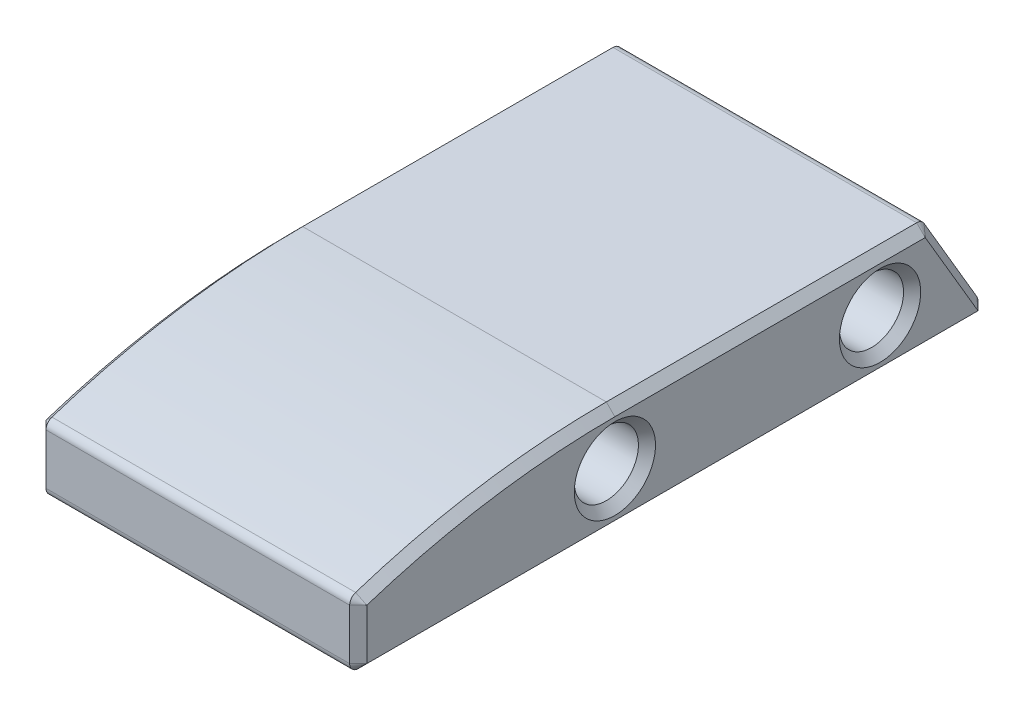
ISO-10303-21;
HEADER;
FILE_DESCRIPTION(('STEP AP214'),'2;1');
FILE_NAME('part.step','',(''),(''),'','','');
FILE_SCHEMA(('AUTOMOTIVE_DESIGN { 1 0 10303 214 1 1 1 1 }'));
ENDSEC;
DATA;
#1=APPLICATION_CONTEXT('core data for automotive mechanical design processes');
#2=APPLICATION_PROTOCOL_DEFINITION('international standard','automotive_design',2000,#1);
#3=PRODUCT_CONTEXT('',#1,'mechanical');
#4=PRODUCT('Part','Part','',(#3));
#5=PRODUCT_RELATED_PRODUCT_CATEGORY('part','',(#4));
#6=PRODUCT_DEFINITION_FORMATION('','',#4);
#7=PRODUCT_DEFINITION_CONTEXT('part definition',#1,'design');
#8=PRODUCT_DEFINITION('design','',#6,#7);
#9=PRODUCT_DEFINITION_SHAPE('','',#8);
#10=(LENGTH_UNIT() NAMED_UNIT(*) SI_UNIT(.MILLI.,.METRE.));
#11=(NAMED_UNIT(*) PLANE_ANGLE_UNIT() SI_UNIT($,.RADIAN.));
#12=(NAMED_UNIT(*) SI_UNIT($,.STERADIAN.) SOLID_ANGLE_UNIT());
#13=UNCERTAINTY_MEASURE_WITH_UNIT(LENGTH_MEASURE(1.E-05),#10,'distance_accuracy_value','');
#14=(GEOMETRIC_REPRESENTATION_CONTEXT(3) GLOBAL_UNCERTAINTY_ASSIGNED_CONTEXT((#13)) GLOBAL_UNIT_ASSIGNED_CONTEXT((#10,
#11,#12)) REPRESENTATION_CONTEXT('',''));
#15=CARTESIAN_POINT('',(0.,0.,0.));
#16=DIRECTION('',(0.,0.,1.));
#17=DIRECTION('',(1.,0.,0.));
#18=AXIS2_PLACEMENT_3D('',#15,#16,#17);
#19=CARTESIAN_POINT('',(-184.456187019321,58.7375,-144.145));
#20=DIRECTION('',(1.,0.,0.));
#21=DIRECTION('',(0.,0.,1.));
#22=AXIS2_PLACEMENT_3D('',#19,#20,#21);
#23=CYLINDRICAL_SURFACE('',#22,4.76250000000001);
#24=CARTESIAN_POINT('',(-87.63,58.7375,-144.145));
#25=DIRECTION('',(-1.,0.,0.));
#26=DIRECTION('',(0.,0.,1.));
#27=AXIS2_PLACEMENT_3D('',#24,#25,#26);
#28=CIRCLE('',#27,4.76250000000001);
#29=CARTESIAN_POINT('',(-87.63,58.7375,-139.3825));
#30=VERTEX_POINT('',#29);
#31=EDGE_CURVE('E236',#30,#30,#28,.T.);
#32=ORIENTED_EDGE('',*,*,#31,.T.);
#33=EDGE_LOOP('',(#32));
#34=FACE_BOUND('',#33,.T.);
#35=CARTESIAN_POINT('',(-42.545,58.7375,-144.145));
#36=DIRECTION('',(-1.,0.,0.));
#37=DIRECTION('',(0.,0.,1.));
#38=AXIS2_PLACEMENT_3D('',#35,#36,#37);
#39=CIRCLE('',#38,4.76250000000001);
#40=CARTESIAN_POINT('',(-42.545,58.7375,-139.3825));
#41=VERTEX_POINT('',#40);
#42=EDGE_CURVE('E233',#41,#41,#39,.F.);
#43=ORIENTED_EDGE('',*,*,#42,.T.);
#44=EDGE_LOOP('',(#43));
#45=FACE_BOUND('',#44,.T.);
#46=ADVANCED_FACE('F41',(#34,#45),#23,.F.);
#47=CARTESIAN_POINT('',(-184.456187019321,66.675,-151.571456432944));
#48=DIRECTION('',(0.,-1.,0.));
#49=DIRECTION('',(0.,0.,-1.));
#50=AXIS2_PLACEMENT_3D('',#47,#48,#49);
#51=PLANE('',#50);
#52=DIRECTION('',(1.,0.,0.));
#53=VECTOR('',#52,1.);
#54=CARTESIAN_POINT('',(-184.456187019321,66.675,-150.844832114314));
#55=LINE('',#54,#53);
#56=CARTESIAN_POINT('',(-42.5450000000001,66.675,-150.844832114314));
#57=VERTEX_POINT('',#56);
#58=CARTESIAN_POINT('',(-87.6299999999999,66.675,-150.844832114314));
#59=VERTEX_POINT('',#58);
#60=EDGE_CURVE('E149',#57,#59,#55,.F.);
#61=ORIENTED_EDGE('',*,*,#60,.T.);
#62=DIRECTION('',(0.,0.,1.));
#63=VECTOR('',#62,1.);
#64=CARTESIAN_POINT('',(-87.6299999999999,66.675,-104.775));
#65=LINE('',#64,#63);
#66=CARTESIAN_POINT('',(-87.6299999999999,66.675,-104.775));
#67=VERTEX_POINT('',#66);
#68=EDGE_CURVE('E155',#59,#67,#65,.T.);
#69=ORIENTED_EDGE('',*,*,#68,.T.);
#70=DIRECTION('',(1.,0.,0.));
#71=VECTOR('',#70,1.);
#72=CARTESIAN_POINT('',(-184.456187019321,66.675,-104.775));
#73=LINE('',#72,#71);
#74=CARTESIAN_POINT('',(-42.5450000000001,66.675,-104.775));
#75=VERTEX_POINT('',#74);
#76=EDGE_CURVE('E151',#67,#75,#73,.T.);
#77=ORIENTED_EDGE('',*,*,#76,.T.);
#78=DIRECTION('',(0.,0.,-1.));
#79=VECTOR('',#78,1.);
#80=CARTESIAN_POINT('',(-42.5450000000001,66.675,-151.571456432944));
#81=LINE('',#80,#79);
#82=EDGE_CURVE('E146',#75,#57,#81,.T.);
#83=ORIENTED_EDGE('',*,*,#82,.T.);
#84=EDGE_LOOP('',(#61,#69,#77,#83));
#85=FACE_BOUND('',#84,.T.);
#86=ADVANCED_FACE('F148',(#85),#51,.F.);
#87=CARTESIAN_POINT('',(-184.456187019321,50.8,-160.903282657976));
#88=DIRECTION('',(0.,-0.50676153252436,0.862086277093866));
#89=DIRECTION('',(0.,-0.862086277093866,-0.50676153252436));
#90=AXIS2_PLACEMENT_3D('',#87,#88,#89);
#91=PLANE('',#90);
#92=DIRECTION('',(1.,0.,0.));
#93=VECTOR('',#92,1.);
#94=CARTESIAN_POINT('',(-184.456187019321,52.713587146306,-159.778415715249));
#95=LINE('',#94,#93);
#96=CARTESIAN_POINT('',(-42.5450000000001,52.713587146306,-159.778415715249));
#97=VERTEX_POINT('',#96);
#98=CARTESIAN_POINT('',(-87.6299999999999,52.713587146306,-159.778415715249));
#99=VERTEX_POINT('',#98);
#100=EDGE_CURVE('E167',#97,#99,#95,.F.);
#101=ORIENTED_EDGE('',*,*,#100,.T.);
#102=DIRECTION('',(0.,0.862086277093866,0.50676153252436));
#103=VECTOR('',#102,1.);
#104=CARTESIAN_POINT('',(-87.6299999999999,66.0485871463059,-151.939681686223));
#105=LINE('',#104,#103);
#106=CARTESIAN_POINT('',(-87.6299999999999,66.048587146306,-151.939681686223));
#107=VERTEX_POINT('',#106);
#108=EDGE_CURVE('E231',#99,#107,#105,.T.);
#109=ORIENTED_EDGE('',*,*,#108,.T.);
#110=DIRECTION('',(1.,0.,0.));
#111=VECTOR('',#110,1.);
#112=CARTESIAN_POINT('',(-184.456187019321,66.048587146306,-151.939681686223));
#113=LINE('',#112,#111);
#114=CARTESIAN_POINT('',(-42.5450000000001,66.048587146306,-151.939681686223));
#115=VERTEX_POINT('',#114);
#116=EDGE_CURVE('E370',#107,#115,#113,.T.);
#117=ORIENTED_EDGE('',*,*,#116,.T.);
#118=DIRECTION('',(0.,-0.862086277093866,-0.50676153252436));
#119=VECTOR('',#118,1.);
#120=CARTESIAN_POINT('',(-42.5450000000001,50.8,-160.903282657976));
#121=LINE('',#120,#119);
#122=EDGE_CURVE('E229',#115,#97,#121,.T.);
#123=ORIENTED_EDGE('',*,*,#122,.T.);
#124=EDGE_LOOP('',(#101,#109,#117,#123));
#125=FACE_BOUND('',#124,.T.);
#126=ADVANCED_FACE('F374',(#125),#91,.F.);
#127=CARTESIAN_POINT('',(-184.456187019321,50.8,-66.675));
#128=DIRECTION('',(0.,1.,0.));
#129=DIRECTION('',(0.,0.,1.));
#130=AXIS2_PLACEMENT_3D('',#127,#128,#129);
#131=PLANE('',#130);
#132=DIRECTION('',(1.,0.,0.));
#133=VECTOR('',#132,1.);
#134=CARTESIAN_POINT('',(-184.456187019321,50.8,-67.945));
#135=LINE('',#134,#133);
#136=CARTESIAN_POINT('',(-42.5450000000001,50.8,-67.945));
#137=VERTEX_POINT('',#136);
#138=CARTESIAN_POINT('',(-87.6299999999999,50.8,-67.945));
#139=VERTEX_POINT('',#138);
#140=EDGE_CURVE('E326',#137,#139,#135,.F.);
#141=ORIENTED_EDGE('',*,*,#140,.T.);
#142=DIRECTION('',(0.,0.,-1.));
#143=VECTOR('',#142,1.);
#144=CARTESIAN_POINT('',(-87.6299999999999,50.8,-158.68356614334));
#145=LINE('',#144,#143);
#146=CARTESIAN_POINT('',(-87.6299999999999,50.8,-158.68356614334));
#147=VERTEX_POINT('',#146);
#148=EDGE_CURVE('E223',#139,#147,#145,.T.);
#149=ORIENTED_EDGE('',*,*,#148,.T.);
#150=DIRECTION('',(1.,0.,0.));
#151=VECTOR('',#150,1.);
#152=CARTESIAN_POINT('',(-184.456187019321,50.8,-158.68356614334));
#153=LINE('',#152,#151);
#154=CARTESIAN_POINT('',(-42.5450000000001,50.8,-158.68356614334));
#155=VERTEX_POINT('',#154);
#156=EDGE_CURVE('E329',#147,#155,#153,.T.);
#157=ORIENTED_EDGE('',*,*,#156,.T.);
#158=DIRECTION('',(0.,0.,1.));
#159=VECTOR('',#158,1.);
#160=CARTESIAN_POINT('',(-42.5450000000001,50.8,-66.675));
#161=LINE('',#160,#159);
#162=EDGE_CURVE('E221',#155,#137,#161,.T.);
#163=ORIENTED_EDGE('',*,*,#162,.T.);
#164=EDGE_LOOP('',(#141,#149,#157,#163));
#165=FACE_BOUND('',#164,.T.);
#166=ADVANCED_FACE('F325',(#165),#131,.F.);
#167=CARTESIAN_POINT('',(-184.456187019321,60.5012529959817,-66.675));
#168=DIRECTION('',(0.,0.,-1.));
#169=DIRECTION('',(0.,1.,0.));
#170=AXIS2_PLACEMENT_3D('',#167,#168,#169);
#171=PLANE('',#170);
#172=DIRECTION('',(1.,0.,0.));
#173=VECTOR('',#172,1.);
#174=CARTESIAN_POINT('',(-184.456187019321,59.5817501296158,-66.675));
#175=LINE('',#174,#173);
#176=CARTESIAN_POINT('',(-42.5450000000001,59.5817501296158,-66.675));
#177=VERTEX_POINT('',#176);
#178=CARTESIAN_POINT('',(-87.6299999999999,59.5817501296158,-66.675));
#179=VERTEX_POINT('',#178);
#180=EDGE_CURVE('E178',#177,#179,#175,.F.);
#181=ORIENTED_EDGE('',*,*,#180,.T.);
#182=DIRECTION('',(0.,-1.,0.));
#183=VECTOR('',#182,1.);
#184=CARTESIAN_POINT('',(-87.6299999999999,52.07,-66.675));
#185=LINE('',#184,#183);
#186=CARTESIAN_POINT('',(-87.6299999999999,52.07,-66.675));
#187=VERTEX_POINT('',#186);
#188=EDGE_CURVE('E214',#179,#187,#185,.T.);
#189=ORIENTED_EDGE('',*,*,#188,.T.);
#190=DIRECTION('',(1.,0.,0.));
#191=VECTOR('',#190,1.);
#192=CARTESIAN_POINT('',(-184.456187019321,52.07,-66.675));
#193=LINE('',#192,#191);
#194=CARTESIAN_POINT('',(-42.5450000000001,52.07,-66.675));
#195=VERTEX_POINT('',#194);
#196=EDGE_CURVE('E182',#187,#195,#193,.T.);
#197=ORIENTED_EDGE('',*,*,#196,.T.);
#198=DIRECTION('',(0.,1.,0.));
#199=VECTOR('',#198,1.);
#200=CARTESIAN_POINT('',(-42.5450000000001,60.5012529959817,-66.675));
#201=LINE('',#200,#199);
#202=EDGE_CURVE('E212',#195,#177,#201,.T.);
#203=ORIENTED_EDGE('',*,*,#202,.T.);
#204=EDGE_LOOP('',(#181,#189,#197,#203));
#205=FACE_BOUND('',#204,.T.);
#206=ADVANCED_FACE('F341',(#205),#171,.F.);
#207=CARTESIAN_POINT('',(-184.456187019321,-53.9749999999997,-104.775));
#208=DIRECTION('',(1.,0.,0.));
#209=DIRECTION('',(0.,0.,1.));
#210=AXIS2_PLACEMENT_3D('',#207,#208,#209);
#211=CYLINDRICAL_SURFACE('',#210,120.65);
#212=ORIENTED_EDGE('',*,*,#76,.F.);
#213=CARTESIAN_POINT('',(-87.6299999999999,-53.9749999999997,-104.775));
#214=DIRECTION('',(-1.,0.,0.));
#215=DIRECTION('',(0.,0.,1.));
#216=AXIS2_PLACEMENT_3D('',#213,#214,#215);
#217=CIRCLE('',#216,120.65);
#218=CARTESIAN_POINT('',(-87.6299999999999,60.7898006629096,-67.5531914893617));
#219=VERTEX_POINT('',#218);
#220=EDGE_CURVE('E206',#67,#219,#217,.F.);
#221=ORIENTED_EDGE('',*,*,#220,.T.);
#222=DIRECTION('',(1.,0.,0.));
#223=VECTOR('',#222,1.);
#224=CARTESIAN_POINT('',(-184.456187019321,60.7898006629096,-67.5531914893617));
#225=LINE('',#224,#223);
#226=CARTESIAN_POINT('',(-42.5450000000001,60.7898006629096,-67.5531914893617));
#227=VERTEX_POINT('',#226);
#228=EDGE_CURVE('E166',#219,#227,#225,.T.);
#229=ORIENTED_EDGE('',*,*,#228,.T.);
#230=CARTESIAN_POINT('',(-42.5450000000001,-53.9749999999997,-104.775));
#231=DIRECTION('',(-1.,0.,0.));
#232=DIRECTION('',(0.,0.,1.));
#233=AXIS2_PLACEMENT_3D('',#230,#231,#232);
#234=CIRCLE('',#233,120.65);
#235=EDGE_CURVE('E204',#227,#75,#234,.T.);
#236=ORIENTED_EDGE('',*,*,#235,.T.);
#237=EDGE_LOOP('',(#212,#221,#229,#236));
#238=FACE_BOUND('',#237,.T.);
#239=ADVANCED_FACE('F416',(#238),#211,.T.);
#240=CARTESIAN_POINT('',(-41.275,-53.9749999999997,-104.775));
#241=DIRECTION('',(-1.,0.,0.));
#242=DIRECTION('',(0.,0.,-1.));
#243=AXIS2_PLACEMENT_3D('',#240,#241,#242);
#244=PLANE('',#243);
#245=CARTESIAN_POINT('',(-41.275,58.7375,-104.775));
#246=DIRECTION('',(-1.,0.,0.));
#247=DIRECTION('',(0.,0.,1.));
#248=AXIS2_PLACEMENT_3D('',#245,#246,#247);
#249=CIRCLE('',#248,6.03250000000001);
#250=CARTESIAN_POINT('',(-41.275,58.7375,-98.7425));
#251=VERTEX_POINT('',#250);
#252=EDGE_CURVE('E11',#251,#251,#249,.T.);
#253=ORIENTED_EDGE('',*,*,#252,.T.);
#254=EDGE_LOOP('',(#253));
#255=FACE_BOUND('',#254,.T.);
#256=CARTESIAN_POINT('',(-41.275,58.7375,-144.145));
#257=DIRECTION('',(-1.,0.,0.));
#258=DIRECTION('',(0.,0.,1.));
#259=AXIS2_PLACEMENT_3D('',#256,#257,#258);
#260=CIRCLE('',#259,6.0325);
#261=CARTESIAN_POINT('',(-41.275,58.7375,-138.1125));
#262=VERTEX_POINT('',#261);
#263=EDGE_CURVE('E51',#262,#262,#260,.T.);
#264=ORIENTED_EDGE('',*,*,#263,.T.);
#265=EDGE_LOOP('',(#264));
#266=FACE_BOUND('',#265,.T.);
#267=CARTESIAN_POINT('',(-41.275,-53.9749999999997,-104.775));
#268=DIRECTION('',(-1.,0.,0.));
#269=DIRECTION('',(0.,0.,1.));
#270=AXIS2_PLACEMENT_3D('',#267,#268,#269);
#271=CIRCLE('',#270,119.38);
#272=CARTESIAN_POINT('',(-41.275,65.405,-104.775));
#273=VERTEX_POINT('',#272);
#274=CARTESIAN_POINT('',(-41.275,59.5817501296158,-67.945));
#275=VERTEX_POINT('',#274);
#276=EDGE_CURVE('E59',#273,#275,#271,.F.);
#277=ORIENTED_EDGE('',*,*,#276,.T.);
#278=DIRECTION('',(0.,-1.,0.));
#279=VECTOR('',#278,1.);
#280=CARTESIAN_POINT('',(-41.275,-53.9749999999996,-67.9449999999997));
#281=LINE('',#280,#279);
#282=CARTESIAN_POINT('',(-41.275,52.07,-67.945));
#283=VERTEX_POINT('',#282);
#284=EDGE_CURVE('E251',#275,#283,#281,.T.);
#285=ORIENTED_EDGE('',*,*,#284,.T.);
#286=DIRECTION('',(0.,0.,-1.));
#287=VECTOR('',#286,1.);
#288=CARTESIAN_POINT('',(-41.275,52.07,-104.775));
#289=LINE('',#288,#287);
#290=CARTESIAN_POINT('',(-41.275,52.07,-158.68356614334));
#291=VERTEX_POINT('',#290);
#292=EDGE_CURVE('E245',#283,#291,#289,.T.);
#293=ORIENTED_EDGE('',*,*,#292,.T.);
#294=DIRECTION('',(0.,0.862086277093866,0.50676153252436));
#295=VECTOR('',#294,1.);
#296=CARTESIAN_POINT('',(-41.275,-3.1907231915063,-191.167563994849));
#297=LINE('',#296,#295);
#298=CARTESIAN_POINT('',(-41.275,65.405,-150.844832114314));
#299=VERTEX_POINT('',#298);
#300=EDGE_CURVE('E247',#291,#299,#297,.T.);
#301=ORIENTED_EDGE('',*,*,#300,.T.);
#302=DIRECTION('',(0.,0.,1.));
#303=VECTOR('',#302,1.);
#304=CARTESIAN_POINT('',(-41.275,65.405,-104.775));
#305=LINE('',#304,#303);
#306=EDGE_CURVE('E64',#299,#273,#305,.T.);
#307=ORIENTED_EDGE('',*,*,#306,.T.);
#308=EDGE_LOOP('',(#277,#285,#293,#301,#307));
#309=FACE_BOUND('',#308,.T.);
#310=ADVANCED_FACE('F308',(#255,#266,#309),#244,.F.);
#311=CARTESIAN_POINT('',(-184.456187019321,58.7375,-104.775));
#312=DIRECTION('',(1.,0.,0.));
#313=DIRECTION('',(0.,0.,1.));
#314=AXIS2_PLACEMENT_3D('',#311,#312,#313);
#315=CYLINDRICAL_SURFACE('',#314,4.7625);
#316=CARTESIAN_POINT('',(-87.63,58.7375,-104.775));
#317=DIRECTION('',(-1.,0.,0.));
#318=DIRECTION('',(0.,0.,1.));
#319=AXIS2_PLACEMENT_3D('',#316,#317,#318);
#320=CIRCLE('',#319,4.7625);
#321=CARTESIAN_POINT('',(-87.63,58.7375,-100.0125));
#322=VERTEX_POINT('',#321);
#323=EDGE_CURVE('E242',#322,#322,#320,.T.);
#324=ORIENTED_EDGE('',*,*,#323,.T.);
#325=EDGE_LOOP('',(#324));
#326=FACE_BOUND('',#325,.T.);
#327=CARTESIAN_POINT('',(-42.545,58.7375,-104.775));
#328=DIRECTION('',(-1.,0.,0.));
#329=DIRECTION('',(0.,0.,1.));
#330=AXIS2_PLACEMENT_3D('',#327,#328,#329);
#331=CIRCLE('',#330,4.7625);
#332=CARTESIAN_POINT('',(-42.545,58.7375,-100.0125));
#333=VERTEX_POINT('',#332);
#334=EDGE_CURVE('E239',#333,#333,#331,.F.);
#335=ORIENTED_EDGE('',*,*,#334,.T.);
#336=EDGE_LOOP('',(#335));
#337=FACE_BOUND('',#336,.T.);
#338=ADVANCED_FACE('F402',(#326,#337),#315,.F.);
#339=CARTESIAN_POINT('',(-88.9,0.,0.));
#340=DIRECTION('',(-1.,0.,0.));
#341=DIRECTION('',(0.,0.,1.));
#342=AXIS2_PLACEMENT_3D('',#339,#340,#341);
#343=PLANE('',#342);
#344=CARTESIAN_POINT('',(-88.9,-53.9749999999997,-104.775));
#345=DIRECTION('',(-1.,0.,0.));
#346=DIRECTION('',(0.,0.,1.));
#347=AXIS2_PLACEMENT_3D('',#344,#345,#346);
#348=CIRCLE('',#347,119.38);
#349=CARTESIAN_POINT('',(-88.9,59.5817501296158,-67.9450000000001));
#350=VERTEX_POINT('',#349);
#351=CARTESIAN_POINT('',(-88.9,65.405,-104.775));
#352=VERTEX_POINT('',#351);
#353=EDGE_CURVE('E199',#350,#352,#348,.T.);
#354=ORIENTED_EDGE('',*,*,#353,.T.);
#355=DIRECTION('',(0.,0.,-1.));
#356=VECTOR('',#355,1.);
#357=CARTESIAN_POINT('',(-88.9,65.405,-150.844832114314));
#358=LINE('',#357,#356);
#359=CARTESIAN_POINT('',(-88.9,65.405,-150.844832114314));
#360=VERTEX_POINT('',#359);
#361=EDGE_CURVE('E201',#352,#360,#358,.T.);
#362=ORIENTED_EDGE('',*,*,#361,.T.);
#363=DIRECTION('',(0.,-0.862086277093866,-0.50676153252436));
#364=VECTOR('',#363,1.);
#365=CARTESIAN_POINT('',(-88.9,52.07,-158.68356614334));
#366=LINE('',#365,#364);
#367=CARTESIAN_POINT('',(-88.9,52.07,-158.68356614334));
#368=VERTEX_POINT('',#367);
#369=EDGE_CURVE('E193',#360,#368,#366,.T.);
#370=ORIENTED_EDGE('',*,*,#369,.T.);
#371=DIRECTION('',(0.,0.,1.));
#372=VECTOR('',#371,1.);
#373=CARTESIAN_POINT('',(-88.9,52.0700000000001,-67.945));
#374=LINE('',#373,#372);
#375=CARTESIAN_POINT('',(-88.9,52.0700000000001,-67.945));
#376=VERTEX_POINT('',#375);
#377=EDGE_CURVE('E195',#368,#376,#374,.T.);
#378=ORIENTED_EDGE('',*,*,#377,.T.);
#379=DIRECTION('',(0.,1.,0.));
#380=VECTOR('',#379,1.);
#381=CARTESIAN_POINT('',(-88.9,59.5817501296158,-67.9450000000001));
#382=LINE('',#381,#380);
#383=EDGE_CURVE('E197',#376,#350,#382,.T.);
#384=ORIENTED_EDGE('',*,*,#383,.T.);
#385=EDGE_LOOP('',(#354,#362,#370,#378,#384));
#386=FACE_BOUND('',#385,.T.);
#387=CARTESIAN_POINT('',(-88.9,58.7375,-144.145));
#388=DIRECTION('',(-1.,0.,0.));
#389=DIRECTION('',(0.,0.,1.));
#390=AXIS2_PLACEMENT_3D('',#387,#388,#389);
#391=CIRCLE('',#390,6.0325);
#392=CARTESIAN_POINT('',(-88.9,58.7375,-138.1125));
#393=VERTEX_POINT('',#392);
#394=EDGE_CURVE('E190',#393,#393,#391,.F.);
#395=ORIENTED_EDGE('',*,*,#394,.T.);
#396=EDGE_LOOP('',(#395));
#397=FACE_BOUND('',#396,.T.);
#398=CARTESIAN_POINT('',(-88.9,58.7375,-104.775));
#399=DIRECTION('',(-1.,0.,0.));
#400=DIRECTION('',(0.,0.,1.));
#401=AXIS2_PLACEMENT_3D('',#398,#399,#400);
#402=CIRCLE('',#401,6.03249999999998);
#403=CARTESIAN_POINT('',(-88.9,58.7375,-98.7425));
#404=VERTEX_POINT('',#403);
#405=EDGE_CURVE('E187',#404,#404,#402,.F.);
#406=ORIENTED_EDGE('',*,*,#405,.T.);
#407=EDGE_LOOP('',(#406));
#408=FACE_BOUND('',#407,.T.);
#409=ADVANCED_FACE('F359',(#386,#397,#408),#343,.T.);
#410=CARTESIAN_POINT('',(-184.456187019321,52.07,-158.68356614334));
#411=DIRECTION('',(1.,0.,0.));
#412=DIRECTION('',(0.,0.,-1.));
#413=AXIS2_PLACEMENT_3D('',#410,#411,#412);
#414=CYLINDRICAL_SURFACE('',#413,1.27);
#415=ORIENTED_EDGE('',*,*,#156,.F.);
#416=CARTESIAN_POINT('',(-87.6299999999999,52.07,-158.68356614334));
#417=DIRECTION('',(-1.,0.,0.));
#418=DIRECTION('',(0.,0.,1.));
#419=AXIS2_PLACEMENT_3D('',#416,#417,#418);
#420=CIRCLE('',#419,1.27);
#421=EDGE_CURVE('E227',#147,#99,#420,.F.);
#422=ORIENTED_EDGE('',*,*,#421,.T.);
#423=ORIENTED_EDGE('',*,*,#100,.F.);
#424=CARTESIAN_POINT('',(-42.5450000000001,52.07,-158.68356614334));
#425=DIRECTION('',(-1.,0.,0.));
#426=DIRECTION('',(0.,0.,1.));
#427=AXIS2_PLACEMENT_3D('',#424,#425,#426);
#428=CIRCLE('',#427,1.27);
#429=EDGE_CURVE('E225',#97,#155,#428,.T.);
#430=ORIENTED_EDGE('',*,*,#429,.T.);
#431=EDGE_LOOP('',(#415,#422,#423,#430));
#432=FACE_BOUND('',#431,.T.);
#433=ADVANCED_FACE('F394',(#432),#414,.T.);
#434=CARTESIAN_POINT('',(-184.456187019321,65.405,-150.844832114314));
#435=DIRECTION('',(1.,0.,0.));
#436=DIRECTION('',(0.,0.,-1.));
#437=AXIS2_PLACEMENT_3D('',#434,#435,#436);
#438=CYLINDRICAL_SURFACE('',#437,1.27);
#439=ORIENTED_EDGE('',*,*,#116,.F.);
#440=CARTESIAN_POINT('',(-87.6299999999999,65.405,-150.844832114314));
#441=DIRECTION('',(-1.,0.,0.));
#442=DIRECTION('',(0.,0.,1.));
#443=AXIS2_PLACEMENT_3D('',#440,#441,#442);
#444=CIRCLE('',#443,1.27);
#445=EDGE_CURVE('E156',#107,#59,#444,.F.);
#446=ORIENTED_EDGE('',*,*,#445,.T.);
#447=ORIENTED_EDGE('',*,*,#60,.F.);
#448=CARTESIAN_POINT('',(-42.5450000000001,65.405,-150.844832114314));
#449=DIRECTION('',(-1.,0.,0.));
#450=DIRECTION('',(0.,0.,1.));
#451=AXIS2_PLACEMENT_3D('',#448,#449,#450);
#452=CIRCLE('',#451,1.27);
#453=EDGE_CURVE('E163',#57,#115,#452,.T.);
#454=ORIENTED_EDGE('',*,*,#453,.T.);
#455=EDGE_LOOP('',(#439,#446,#447,#454));
#456=FACE_BOUND('',#455,.T.);
#457=ADVANCED_FACE('F161',(#456),#438,.T.);
#458=CARTESIAN_POINT('',(-184.456187019321,59.5817501296158,-67.945));
#459=DIRECTION('',(1.,0.,0.));
#460=DIRECTION('',(0.,0.,-1.));
#461=AXIS2_PLACEMENT_3D('',#458,#459,#460);
#462=CYLINDRICAL_SURFACE('',#461,1.27);
#463=ORIENTED_EDGE('',*,*,#228,.F.);
#464=CARTESIAN_POINT('',(-87.6299999999999,59.5817501296158,-67.945));
#465=DIRECTION('',(-1.,0.,0.));
#466=DIRECTION('',(0.,0.,1.));
#467=AXIS2_PLACEMENT_3D('',#464,#465,#466);
#468=CIRCLE('',#467,1.27);
#469=EDGE_CURVE('E210',#219,#179,#468,.F.);
#470=ORIENTED_EDGE('',*,*,#469,.T.);
#471=ORIENTED_EDGE('',*,*,#180,.F.);
#472=CARTESIAN_POINT('',(-42.5450000000001,59.5817501296158,-67.945));
#473=DIRECTION('',(-1.,0.,0.));
#474=DIRECTION('',(0.,0.,1.));
#475=AXIS2_PLACEMENT_3D('',#472,#473,#474);
#476=CIRCLE('',#475,1.27);
#477=EDGE_CURVE('E208',#177,#227,#476,.T.);
#478=ORIENTED_EDGE('',*,*,#477,.T.);
#479=EDGE_LOOP('',(#463,#470,#471,#478));
#480=FACE_BOUND('',#479,.T.);
#481=ADVANCED_FACE('F345',(#480),#462,.T.);
#482=CARTESIAN_POINT('',(-184.456187019321,52.07,-67.945));
#483=DIRECTION('',(1.,0.,0.));
#484=DIRECTION('',(0.,0.,-1.));
#485=AXIS2_PLACEMENT_3D('',#482,#483,#484);
#486=CYLINDRICAL_SURFACE('',#485,1.27);
#487=ORIENTED_EDGE('',*,*,#196,.F.);
#488=CARTESIAN_POINT('',(-87.6299999999999,52.07,-67.945));
#489=DIRECTION('',(-1.,0.,0.));
#490=DIRECTION('',(0.,0.,1.));
#491=AXIS2_PLACEMENT_3D('',#488,#489,#490);
#492=CIRCLE('',#491,1.27);
#493=EDGE_CURVE('E219',#187,#139,#492,.F.);
#494=ORIENTED_EDGE('',*,*,#493,.T.);
#495=ORIENTED_EDGE('',*,*,#140,.F.);
#496=CARTESIAN_POINT('',(-42.5450000000001,52.07,-67.945));
#497=DIRECTION('',(-1.,0.,0.));
#498=DIRECTION('',(0.,0.,1.));
#499=AXIS2_PLACEMENT_3D('',#496,#497,#498);
#500=CIRCLE('',#499,1.27);
#501=EDGE_CURVE('E216',#137,#195,#500,.T.);
#502=ORIENTED_EDGE('',*,*,#501,.T.);
#503=EDGE_LOOP('',(#487,#494,#495,#502));
#504=FACE_BOUND('',#503,.T.);
#505=ADVANCED_FACE('F333',(#504),#486,.T.);
#506=CARTESIAN_POINT('',(-87.6299999999999,60.5012529959817,-66.675));
#507=DIRECTION('',(-0.707106781186553,0.,0.707106781186542));
#508=DIRECTION('',(0.,1.,0.));
#509=AXIS2_PLACEMENT_3D('',#506,#507,#508);
#510=PLANE('',#509);
#511=DIRECTION('',(-0.707106781186544,0.,-0.707106781186551));
#512=VECTOR('',#511,1.);
#513=CARTESIAN_POINT('',(-87.6299999999999,52.07,-66.675));
#514=LINE('',#513,#512);
#515=EDGE_CURVE('E276',#187,#376,#514,.T.);
#516=ORIENTED_EDGE('',*,*,#515,.F.);
#517=ORIENTED_EDGE('',*,*,#188,.F.);
#518=DIRECTION('',(0.707106781186544,0.,0.707106781186551));
#519=VECTOR('',#518,1.);
#520=CARTESIAN_POINT('',(-88.9,59.5817501296158,-67.9450000000001));
#521=LINE('',#520,#519);
#522=EDGE_CURVE('E273',#350,#179,#521,.T.);
#523=ORIENTED_EDGE('',*,*,#522,.F.);
#524=ORIENTED_EDGE('',*,*,#383,.F.);
#525=EDGE_LOOP('',(#516,#517,#523,#524));
#526=FACE_BOUND('',#525,.T.);
#527=ADVANCED_FACE('F365',(#526),#510,.T.);
#528=CARTESIAN_POINT('',(-87.6299999999999,52.07,-67.945));
#529=DIRECTION('',(1.,0.,0.));
#530=DIRECTION('',(0.,0.,-1.));
#531=AXIS2_PLACEMENT_3D('',#528,#529,#530);
#532=CONICAL_SURFACE('',#531,1.27000000000004,0.785398163397452);
#533=ORIENTED_EDGE('',*,*,#493,.F.);
#534=ORIENTED_EDGE('',*,*,#515,.T.);
#535=DIRECTION('',(-0.707106781186546,0.707106781186549,0.));
#536=VECTOR('',#535,1.);
#537=CARTESIAN_POINT('',(-87.6299999999999,50.8,-67.945));
#538=LINE('',#537,#536);
#539=EDGE_CURVE('E270',#139,#376,#538,.T.);
#540=ORIENTED_EDGE('',*,*,#539,.F.);
#541=EDGE_LOOP('',(#533,#534,#540));
#542=FACE_BOUND('',#541,.T.);
#543=ADVANCED_FACE('F484',(#542),#532,.T.);
#544=CARTESIAN_POINT('',(-87.6299999999999,59.5817501296158,-67.945));
#545=DIRECTION('',(1.,0.,0.));
#546=DIRECTION('',(0.,0.,-1.));
#547=AXIS2_PLACEMENT_3D('',#544,#545,#546);
#548=CONICAL_SURFACE('',#547,1.27000000000004,0.785398163397452);
#549=ORIENTED_EDGE('',*,*,#522,.T.);
#550=ORIENTED_EDGE('',*,*,#469,.F.);
#551=DIRECTION('',(0.707106781186543,0.672614743392178,0.218149964408619));
#552=VECTOR('',#551,1.);
#553=CARTESIAN_POINT('',(-88.9,59.5817501296158,-67.945));
#554=LINE('',#553,#552);
#555=EDGE_CURVE('E267',#350,#219,#554,.T.);
#556=ORIENTED_EDGE('',*,*,#555,.F.);
#557=EDGE_LOOP('',(#549,#550,#556));
#558=FACE_BOUND('',#557,.T.);
#559=ADVANCED_FACE('F350',(#558),#548,.T.);
#560=CARTESIAN_POINT('',(-87.6299999999999,50.8,-66.675));
#561=DIRECTION('',(-0.707106781186549,-0.707106781186546,0.));
#562=DIRECTION('',(0.,0.,1.));
#563=AXIS2_PLACEMENT_3D('',#560,#561,#562);
#564=PLANE('',#563);
#565=ORIENTED_EDGE('',*,*,#539,.T.);
#566=ORIENTED_EDGE('',*,*,#377,.F.);
#567=DIRECTION('',(-0.707106781186546,0.707106781186549,0.));
#568=VECTOR('',#567,1.);
#569=CARTESIAN_POINT('',(-87.6299999999999,50.8,-158.68356614334));
#570=LINE('',#569,#568);
#571=EDGE_CURVE('E264',#147,#368,#570,.T.);
#572=ORIENTED_EDGE('',*,*,#571,.F.);
#573=ORIENTED_EDGE('',*,*,#148,.F.);
#574=EDGE_LOOP('',(#565,#566,#572,#573));
#575=FACE_BOUND('',#574,.T.);
#576=ADVANCED_FACE('F388',(#575),#564,.T.);
#577=CARTESIAN_POINT('',(-87.6299999999999,-53.9749999999997,-104.775));
#578=DIRECTION('',(1.,0.,0.));
#579=DIRECTION('',(0.,0.,-1.));
#580=AXIS2_PLACEMENT_3D('',#577,#578,#579);
#581=CONICAL_SURFACE('',#580,120.65,0.785398163397454);
#582=ORIENTED_EDGE('',*,*,#555,.T.);
#583=ORIENTED_EDGE('',*,*,#220,.F.);
#584=DIRECTION('',(0.707106781186544,0.707106781186551,0.));
#585=VECTOR('',#584,1.);
#586=CARTESIAN_POINT('',(-88.9,65.405,-104.775));
#587=LINE('',#586,#585);
#588=EDGE_CURVE('E261',#352,#67,#587,.T.);
#589=ORIENTED_EDGE('',*,*,#588,.F.);
#590=ORIENTED_EDGE('',*,*,#353,.F.);
#591=EDGE_LOOP('',(#582,#583,#589,#590));
#592=FACE_BOUND('',#591,.T.);
#593=ADVANCED_FACE('F355',(#592),#581,.T.);
#594=CARTESIAN_POINT('',(-87.6299999999999,52.07,-158.68356614334));
#595=DIRECTION('',(1.,0.,0.));
#596=DIRECTION('',(0.,0.,-1.));
#597=AXIS2_PLACEMENT_3D('',#594,#595,#596);
#598=CONICAL_SURFACE('',#597,1.27000000000004,0.785398163397452);
#599=ORIENTED_EDGE('',*,*,#421,.F.);
#600=ORIENTED_EDGE('',*,*,#571,.T.);
#601=DIRECTION('',(-0.707106781186556,-0.35833451609245,0.609587052500935));
#602=VECTOR('',#601,1.);
#603=CARTESIAN_POINT('',(-87.6299999999999,52.7135871463059,-159.778415715249));
#604=LINE('',#603,#602);
#605=EDGE_CURVE('E258',#99,#368,#604,.T.);
#606=ORIENTED_EDGE('',*,*,#605,.F.);
#607=EDGE_LOOP('',(#599,#600,#606));
#608=FACE_BOUND('',#607,.T.);
#609=ADVANCED_FACE('F392',(#608),#598,.T.);
#610=CARTESIAN_POINT('',(-87.6299999999999,66.675,-151.571456432944));
#611=DIRECTION('',(-0.707106781186551,0.707106781186544,0.));
#612=DIRECTION('',(0.,0.,-1.));
#613=AXIS2_PLACEMENT_3D('',#610,#611,#612);
#614=PLANE('',#613);
#615=ORIENTED_EDGE('',*,*,#588,.T.);
#616=ORIENTED_EDGE('',*,*,#68,.F.);
#617=DIRECTION('',(0.707106781186544,0.707106781186551,0.));
#618=VECTOR('',#617,1.);
#619=CARTESIAN_POINT('',(-88.9,65.405,-150.844832114314));
#620=LINE('',#619,#618);
#621=EDGE_CURVE('E256',#360,#59,#620,.T.);
#622=ORIENTED_EDGE('',*,*,#621,.F.);
#623=ORIENTED_EDGE('',*,*,#361,.F.);
#624=EDGE_LOOP('',(#615,#616,#622,#623));
#625=FACE_BOUND('',#624,.T.);
#626=ADVANCED_FACE('F531',(#625),#614,.T.);
#627=CARTESIAN_POINT('',(-87.6299999999999,50.8,-160.903282657976));
#628=DIRECTION('',(-0.707106781186555,0.358334516092458,-0.609587052500931));
#629=DIRECTION('',(0.,-0.862086277093866,-0.50676153252436));
#630=AXIS2_PLACEMENT_3D('',#627,#628,#629);
#631=PLANE('',#630);
#632=ORIENTED_EDGE('',*,*,#605,.T.);
#633=ORIENTED_EDGE('',*,*,#369,.F.);
#634=DIRECTION('',(-0.707106781186536,-0.358334516092464,0.60958705250095));
#635=VECTOR('',#634,1.);
#636=CARTESIAN_POINT('',(-87.6299999999999,66.048587146306,-151.939681686223));
#637=LINE('',#636,#635);
#638=EDGE_CURVE('E173',#107,#360,#637,.T.);
#639=ORIENTED_EDGE('',*,*,#638,.F.);
#640=ORIENTED_EDGE('',*,*,#108,.F.);
#641=EDGE_LOOP('',(#632,#633,#639,#640));
#642=FACE_BOUND('',#641,.T.);
#643=ADVANCED_FACE('F384',(#642),#631,.T.);
#644=CARTESIAN_POINT('',(-87.6299999999999,65.405,-150.844832114314));
#645=DIRECTION('',(1.,0.,0.));
#646=DIRECTION('',(0.,0.,-1.));
#647=AXIS2_PLACEMENT_3D('',#644,#645,#646);
#648=CONICAL_SURFACE('',#647,1.27000000000004,0.785398163397452);
#649=ORIENTED_EDGE('',*,*,#621,.T.);
#650=ORIENTED_EDGE('',*,*,#445,.F.);
#651=ORIENTED_EDGE('',*,*,#638,.T.);
#652=EDGE_LOOP('',(#649,#650,#651));
#653=FACE_BOUND('',#652,.T.);
#654=ADVANCED_FACE('F379',(#653),#648,.T.);
#655=CARTESIAN_POINT('',(-88.9,58.7375,-144.145));
#656=DIRECTION('',(-1.,0.,0.));
#657=DIRECTION('',(0.,0.,1.));
#658=AXIS2_PLACEMENT_3D('',#655,#656,#657);
#659=CONICAL_SURFACE('',#658,6.0325,0.785398163397445);
#660=ORIENTED_EDGE('',*,*,#31,.F.);
#661=EDGE_LOOP('',(#660));
#662=FACE_BOUND('',#661,.T.);
#663=ORIENTED_EDGE('',*,*,#394,.F.);
#664=EDGE_LOOP('',(#663));
#665=FACE_BOUND('',#664,.T.);
#666=ADVANCED_FACE('F560',(#662,#665),#659,.F.);
#667=CARTESIAN_POINT('',(-88.9,58.7375,-104.775));
#668=DIRECTION('',(-1.,0.,0.));
#669=DIRECTION('',(0.,0.,1.));
#670=AXIS2_PLACEMENT_3D('',#667,#668,#669);
#671=CONICAL_SURFACE('',#670,6.03249999999998,0.785398163397445);
#672=ORIENTED_EDGE('',*,*,#323,.F.);
#673=EDGE_LOOP('',(#672));
#674=FACE_BOUND('',#673,.T.);
#675=ORIENTED_EDGE('',*,*,#405,.F.);
#676=EDGE_LOOP('',(#675));
#677=FACE_BOUND('',#676,.T.);
#678=ADVANCED_FACE('F570',(#674,#677),#671,.F.);
#679=CARTESIAN_POINT('',(-42.545,58.7375,-104.775));
#680=DIRECTION('',(1.,0.,0.));
#681=DIRECTION('',(0.,0.,-1.));
#682=AXIS2_PLACEMENT_3D('',#679,#680,#681);
#683=CONICAL_SURFACE('',#682,4.7625,0.785398163397456);
#684=ORIENTED_EDGE('',*,*,#252,.F.);
#685=EDGE_LOOP('',(#684));
#686=FACE_BOUND('',#685,.T.);
#687=ORIENTED_EDGE('',*,*,#334,.F.);
#688=EDGE_LOOP('',(#687));
#689=FACE_BOUND('',#688,.T.);
#690=ADVANCED_FACE('F581',(#686,#689),#683,.F.);
#691=CARTESIAN_POINT('',(-42.545,58.7375,-144.145));
#692=DIRECTION('',(1.,0.,0.));
#693=DIRECTION('',(0.,0.,-1.));
#694=AXIS2_PLACEMENT_3D('',#691,#692,#693);
#695=CONICAL_SURFACE('',#694,4.76250000000001,0.785398163397445);
#696=ORIENTED_EDGE('',*,*,#263,.F.);
#697=EDGE_LOOP('',(#696));
#698=FACE_BOUND('',#697,.T.);
#699=ORIENTED_EDGE('',*,*,#42,.F.);
#700=EDGE_LOOP('',(#699));
#701=FACE_BOUND('',#700,.T.);
#702=ADVANCED_FACE('F592',(#698,#701),#695,.F.);
#703=CARTESIAN_POINT('',(-41.275,65.405,-104.775));
#704=DIRECTION('',(-0.70710678118654,-0.707106781186555,0.));
#705=DIRECTION('',(0.,0.,1.));
#706=AXIS2_PLACEMENT_3D('',#703,#704,#705);
#707=PLANE('',#706);
#708=DIRECTION('',(0.707106781186555,-0.70710678118654,0.));
#709=VECTOR('',#708,1.);
#710=CARTESIAN_POINT('',(-42.5450000000001,66.675,-150.844832114314));
#711=LINE('',#710,#709);
#712=EDGE_CURVE('E46',#57,#299,#711,.T.);
#713=ORIENTED_EDGE('',*,*,#712,.F.);
#714=ORIENTED_EDGE('',*,*,#82,.F.);
#715=DIRECTION('',(-0.707106781186555,0.70710678118654,0.));
#716=VECTOR('',#715,1.);
#717=CARTESIAN_POINT('',(-41.275,65.405,-104.775));
#718=LINE('',#717,#716);
#719=EDGE_CURVE('E174',#273,#75,#718,.T.);
#720=ORIENTED_EDGE('',*,*,#719,.F.);
#721=ORIENTED_EDGE('',*,*,#306,.F.);
#722=EDGE_LOOP('',(#713,#714,#720,#721));
#723=FACE_BOUND('',#722,.T.);
#724=ADVANCED_FACE('F44',(#723),#707,.F.);
#725=CARTESIAN_POINT('',(-42.5450000000001,65.405,-150.844832114314));
#726=DIRECTION('',(-1.,0.,0.));
#727=DIRECTION('',(0.,0.,1.));
#728=AXIS2_PLACEMENT_3D('',#725,#726,#727);
#729=CONICAL_SURFACE('',#728,1.26999999999999,0.785398163397437);
#730=ORIENTED_EDGE('',*,*,#453,.F.);
#731=ORIENTED_EDGE('',*,*,#712,.T.);
#732=DIRECTION('',(0.707106781186558,-0.358334516092456,0.609587052500929));
#733=VECTOR('',#732,1.);
#734=CARTESIAN_POINT('',(-42.5450000000001,66.048587146306,-151.939681686223));
#735=LINE('',#734,#733);
#736=EDGE_CURVE('E176',#115,#299,#735,.T.);
#737=ORIENTED_EDGE('',*,*,#736,.F.);
#738=EDGE_LOOP('',(#730,#731,#737));
#739=FACE_BOUND('',#738,.T.);
#740=ADVANCED_FACE('F175',(#739),#729,.T.);
#741=CARTESIAN_POINT('',(-41.275,-53.9749999999997,-104.775));
#742=DIRECTION('',(-1.,0.,0.));
#743=DIRECTION('',(0.,0.,1.));
#744=AXIS2_PLACEMENT_3D('',#741,#742,#743);
#745=CONICAL_SURFACE('',#744,119.38,0.785398163397437);
#746=ORIENTED_EDGE('',*,*,#719,.T.);
#747=ORIENTED_EDGE('',*,*,#235,.F.);
#748=DIRECTION('',(-0.707106781186561,0.672614743392161,0.218149964408611));
#749=VECTOR('',#748,1.);
#750=CARTESIAN_POINT('',(-41.275,59.5817501296158,-67.945));
#751=LINE('',#750,#749);
#752=EDGE_CURVE('E292',#275,#227,#751,.T.);
#753=ORIENTED_EDGE('',*,*,#752,.F.);
#754=ORIENTED_EDGE('',*,*,#276,.F.);
#755=EDGE_LOOP('',(#746,#747,#753,#754));
#756=FACE_BOUND('',#755,.T.);
#757=ADVANCED_FACE('F297',(#756),#745,.T.);
#758=CARTESIAN_POINT('',(-41.275,-3.19072319150628,-191.167563994849));
#759=DIRECTION('',(-0.707106781186543,-0.358334516092465,0.609587052500942));
#760=DIRECTION('',(0.,0.862086277093866,0.50676153252436));
#761=AXIS2_PLACEMENT_3D('',#758,#759,#760);
#762=PLANE('',#761);
#763=ORIENTED_EDGE('',*,*,#736,.T.);
#764=ORIENTED_EDGE('',*,*,#300,.F.);
#765=DIRECTION('',(0.707106781186551,-0.358334516092462,0.609587052500934));
#766=VECTOR('',#765,1.);
#767=CARTESIAN_POINT('',(-42.5450000000001,52.7135871463059,-159.778415715249));
#768=LINE('',#767,#766);
#769=EDGE_CURVE('E289',#97,#291,#768,.T.);
#770=ORIENTED_EDGE('',*,*,#769,.F.);
#771=ORIENTED_EDGE('',*,*,#122,.F.);
#772=EDGE_LOOP('',(#763,#764,#770,#771));
#773=FACE_BOUND('',#772,.T.);
#774=ADVANCED_FACE('F314',(#773),#762,.F.);
#775=CARTESIAN_POINT('',(-42.5450000000001,59.5817501296158,-67.945));
#776=DIRECTION('',(-1.,0.,0.));
#777=DIRECTION('',(0.,0.,1.));
#778=AXIS2_PLACEMENT_3D('',#775,#776,#777);
#779=CONICAL_SURFACE('',#778,1.26999999999999,0.785398163397437);
#780=ORIENTED_EDGE('',*,*,#752,.T.);
#781=ORIENTED_EDGE('',*,*,#477,.F.);
#782=DIRECTION('',(-0.707106781186551,0.,0.707106781186544));
#783=VECTOR('',#782,1.);
#784=CARTESIAN_POINT('',(-41.275,59.5817501296158,-67.945));
#785=LINE('',#784,#783);
#786=EDGE_CURVE('E286',#275,#177,#785,.T.);
#787=ORIENTED_EDGE('',*,*,#786,.F.);
#788=EDGE_LOOP('',(#780,#781,#787));
#789=FACE_BOUND('',#788,.T.);
#790=ADVANCED_FACE('F302',(#789),#779,.T.);
#791=CARTESIAN_POINT('',(-42.5450000000001,52.07,-158.68356614334));
#792=DIRECTION('',(-1.,0.,0.));
#793=DIRECTION('',(0.,0.,1.));
#794=AXIS2_PLACEMENT_3D('',#791,#792,#793);
#795=CONICAL_SURFACE('',#794,1.26999999999999,0.785398163397437);
#796=ORIENTED_EDGE('',*,*,#429,.F.);
#797=ORIENTED_EDGE('',*,*,#769,.T.);
#798=DIRECTION('',(0.707106781186555,0.70710678118654,0.));
#799=VECTOR('',#798,1.);
#800=CARTESIAN_POINT('',(-42.5450000000001,50.8,-158.68356614334));
#801=LINE('',#800,#799);
#802=EDGE_CURVE('E283',#155,#291,#801,.T.);
#803=ORIENTED_EDGE('',*,*,#802,.F.);
#804=EDGE_LOOP('',(#796,#797,#803));
#805=FACE_BOUND('',#804,.T.);
#806=ADVANCED_FACE('F318',(#805),#795,.T.);
#807=CARTESIAN_POINT('',(-41.275,-53.9749999999996,-67.9449999999997));
#808=DIRECTION('',(-0.707106781186538,0.,-0.707106781186557));
#809=DIRECTION('',(0.,-1.,0.));
#810=AXIS2_PLACEMENT_3D('',#807,#808,#809);
#811=PLANE('',#810);
#812=ORIENTED_EDGE('',*,*,#786,.T.);
#813=ORIENTED_EDGE('',*,*,#202,.F.);
#814=DIRECTION('',(-0.707106781186555,0.,0.70710678118654));
#815=VECTOR('',#814,1.);
#816=CARTESIAN_POINT('',(-41.275,52.07,-67.945));
#817=LINE('',#816,#815);
#818=EDGE_CURVE('E281',#283,#195,#817,.T.);
#819=ORIENTED_EDGE('',*,*,#818,.F.);
#820=ORIENTED_EDGE('',*,*,#284,.F.);
#821=EDGE_LOOP('',(#812,#813,#819,#820));
#822=FACE_BOUND('',#821,.T.);
#823=ADVANCED_FACE('F306',(#822),#811,.F.);
#824=CARTESIAN_POINT('',(-41.275,52.07,-104.775));
#825=DIRECTION('',(-0.70710678118654,0.707106781186555,0.));
#826=DIRECTION('',(0.,0.,-1.));
#827=AXIS2_PLACEMENT_3D('',#824,#825,#826);
#828=PLANE('',#827);
#829=ORIENTED_EDGE('',*,*,#802,.T.);
#830=ORIENTED_EDGE('',*,*,#292,.F.);
#831=DIRECTION('',(0.707106781186555,0.70710678118654,0.));
#832=VECTOR('',#831,1.);
#833=CARTESIAN_POINT('',(-42.5450000000001,50.8,-67.945));
#834=LINE('',#833,#832);
#835=EDGE_CURVE('E279',#137,#283,#834,.T.);
#836=ORIENTED_EDGE('',*,*,#835,.F.);
#837=ORIENTED_EDGE('',*,*,#162,.F.);
#838=EDGE_LOOP('',(#829,#830,#836,#837));
#839=FACE_BOUND('',#838,.T.);
#840=ADVANCED_FACE('F320',(#839),#828,.F.);
#841=CARTESIAN_POINT('',(-42.5450000000001,52.07,-67.945));
#842=DIRECTION('',(-1.,0.,0.));
#843=DIRECTION('',(0.,0.,1.));
#844=AXIS2_PLACEMENT_3D('',#841,#842,#843);
#845=CONICAL_SURFACE('',#844,1.26999999999999,0.785398163397437);
#846=ORIENTED_EDGE('',*,*,#818,.T.);
#847=ORIENTED_EDGE('',*,*,#501,.F.);
#848=ORIENTED_EDGE('',*,*,#835,.T.);
#849=EDGE_LOOP('',(#846,#847,#848));
#850=FACE_BOUND('',#849,.T.);
#851=ADVANCED_FACE('F338',(#850),#845,.T.);
#852=CLOSED_SHELL('',(#46,#86,#126,#166,#206,#239,#310,#338,#409,#433,#457,#481,#505,#527,#543,
#559,#576,#593,#609,#626,#643,#654,#666,#678,#690,#702,#724,#740,#757,#774,#790,#806,#823,#840,#851));
#853=MANIFOLD_SOLID_BREP('B2',#852);
#854=ADVANCED_BREP_SHAPE_REPRESENTATION('',(#18,#853),#14);
#855=SHAPE_DEFINITION_REPRESENTATION(#9,#854);
ENDSEC;
END-ISO-10303-21;
